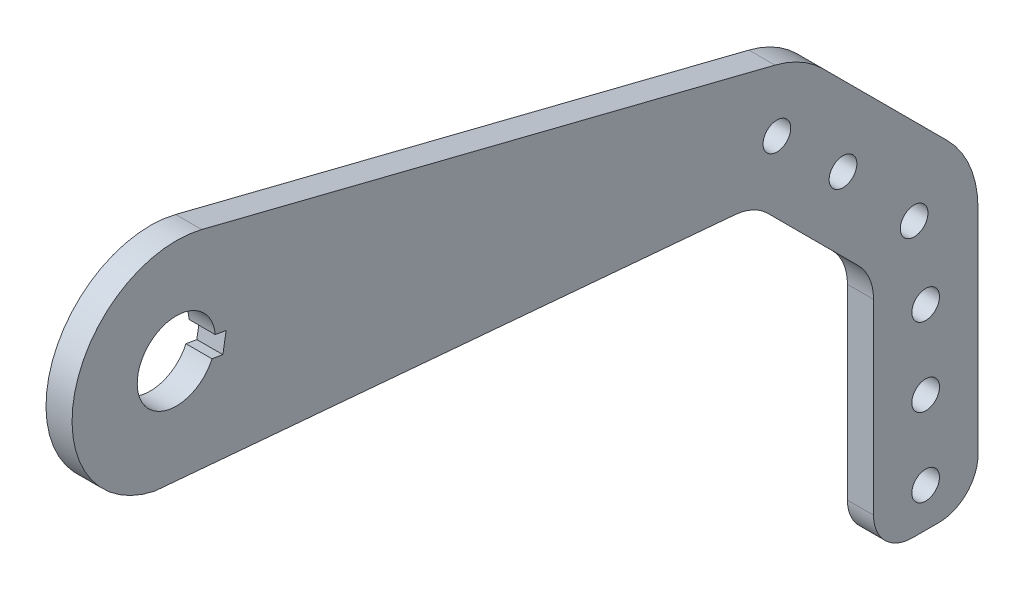
ISO-10303-21;
HEADER;
FILE_DESCRIPTION(('STEP AP214'),'2;1');
FILE_NAME('part.step','',(''),(''),'','','');
FILE_SCHEMA(('AUTOMOTIVE_DESIGN { 1 0 10303 214 1 1 1 1 }'));
ENDSEC;
DATA;
#1=APPLICATION_CONTEXT('core data for automotive mechanical design processes');
#2=APPLICATION_PROTOCOL_DEFINITION('international standard','automotive_design',2000,#1);
#3=PRODUCT_CONTEXT('',#1,'mechanical');
#4=PRODUCT('Part','Part','',(#3));
#5=PRODUCT_RELATED_PRODUCT_CATEGORY('part','',(#4));
#6=PRODUCT_DEFINITION_FORMATION('','',#4);
#7=PRODUCT_DEFINITION_CONTEXT('part definition',#1,'design');
#8=PRODUCT_DEFINITION('design','',#6,#7);
#9=PRODUCT_DEFINITION_SHAPE('','',#8);
#10=(LENGTH_UNIT() NAMED_UNIT(*) SI_UNIT(.MILLI.,.METRE.));
#11=(NAMED_UNIT(*) PLANE_ANGLE_UNIT() SI_UNIT($,.RADIAN.));
#12=(NAMED_UNIT(*) SI_UNIT($,.STERADIAN.) SOLID_ANGLE_UNIT());
#13=UNCERTAINTY_MEASURE_WITH_UNIT(LENGTH_MEASURE(1.E-05),#10,'distance_accuracy_value','');
#14=(GEOMETRIC_REPRESENTATION_CONTEXT(3) GLOBAL_UNCERTAINTY_ASSIGNED_CONTEXT((#13)) GLOBAL_UNIT_ASSIGNED_CONTEXT((#10,
#11,#12)) REPRESENTATION_CONTEXT('',''));
#15=CARTESIAN_POINT('',(0.,0.,0.));
#16=DIRECTION('',(0.,0.,1.));
#17=DIRECTION('',(1.,0.,0.));
#18=AXIS2_PLACEMENT_3D('',#15,#16,#17);
#19=CARTESIAN_POINT('',(12.7,0.,0.));
#20=DIRECTION('',(-1.,0.,0.));
#21=DIRECTION('',(0.,0.,1.));
#22=AXIS2_PLACEMENT_3D('',#19,#20,#21);
#23=CYLINDRICAL_SURFACE('',#22,50.8);
#24=CARTESIAN_POINT('',(0.,0.,0.));
#25=DIRECTION('',(1.,0.,0.));
#26=DIRECTION('',(0.,0.,-1.));
#27=AXIS2_PLACEMENT_3D('',#24,#25,#26);
#28=CIRCLE('',#27,50.8);
#29=CARTESIAN_POINT('',(0.,49.2644127270495,-12.3958718394036));
#30=VERTEX_POINT('',#29);
#31=CARTESIAN_POINT('',(0.,-49.6627771065191,10.6887122736185));
#32=VERTEX_POINT('',#31);
#33=EDGE_CURVE('E186',#30,#32,#28,.T.);
#34=ORIENTED_EDGE('',*,*,#33,.T.);
#35=DIRECTION('',(-1.,0.,0.));
#36=VECTOR('',#35,1.);
#37=CARTESIAN_POINT('',(12.7,-49.6627771065191,10.6887122736185));
#38=LINE('',#37,#36);
#39=CARTESIAN_POINT('',(12.7,-49.6627771065191,10.6887122736185));
#40=VERTEX_POINT('',#39);
#41=EDGE_CURVE('E220',#40,#32,#38,.T.);
#42=ORIENTED_EDGE('',*,*,#41,.F.);
#43=CARTESIAN_POINT('',(12.7,0.,0.));
#44=DIRECTION('',(1.,0.,0.));
#45=DIRECTION('',(0.,0.,-1.));
#46=AXIS2_PLACEMENT_3D('',#43,#44,#45);
#47=CIRCLE('',#46,50.8);
#48=CARTESIAN_POINT('',(12.7,49.2644127270495,-12.3958718394036));
#49=VERTEX_POINT('',#48);
#50=EDGE_CURVE('E356',#49,#40,#47,.T.);
#51=ORIENTED_EDGE('',*,*,#50,.F.);
#52=DIRECTION('',(-1.,0.,0.));
#53=VECTOR('',#52,1.);
#54=CARTESIAN_POINT('',(12.7,49.2644127270495,-12.3958718394036));
#55=LINE('',#54,#53);
#56=EDGE_CURVE('E217',#49,#30,#55,.T.);
#57=ORIENTED_EDGE('',*,*,#56,.T.);
#58=EDGE_LOOP('',(#34,#42,#51,#57));
#59=FACE_BOUND('',#58,.T.);
#60=ADVANCED_FACE('F37',(#59),#23,.T.);
#61=CARTESIAN_POINT('',(12.7,-50.2135702225281,4.39311814963394));
#62=DIRECTION('',(0.,0.996194698091746,-0.0871557427476547));
#63=DIRECTION('',(0.,0.0871557427476547,0.996194698091746));
#64=AXIS2_PLACEMENT_3D('',#61,#62,#63);
#65=PLANE('',#64);
#66=DIRECTION('',(0.,-0.0871557427476547,-0.996194698091746));
#67=VECTOR('',#66,1.);
#68=CARTESIAN_POINT('',(0.,-50.2135702225281,4.39311814963394));
#69=LINE('',#68,#67);
#70=CARTESIAN_POINT('',(0.,-74.4299171547794,-272.400993867823));
#71=VERTEX_POINT('',#70);
#72=EDGE_CURVE('E190',#32,#71,#69,.T.);
#73=ORIENTED_EDGE('',*,*,#72,.T.);
#74=DIRECTION('',(-1.,0.,0.));
#75=VECTOR('',#74,1.);
#76=CARTESIAN_POINT('',(12.7,-74.4299171547794,-272.400993867823));
#77=LINE('',#76,#75);
#78=CARTESIAN_POINT('',(12.7,-74.4299171547794,-272.400993867823));
#79=VERTEX_POINT('',#78);
#80=EDGE_CURVE('E231',#71,#79,#77,.F.);
#81=ORIENTED_EDGE('',*,*,#80,.T.);
#82=DIRECTION('',(0.,-0.0871557427476547,-0.996194698091746));
#83=VECTOR('',#82,1.);
#84=CARTESIAN_POINT('',(12.7,-50.2135702225281,4.39311814963394));
#85=LINE('',#84,#83);
#86=EDGE_CURVE('E331',#40,#79,#85,.T.);
#87=ORIENTED_EDGE('',*,*,#86,.F.);
#88=ORIENTED_EDGE('',*,*,#41,.T.);
#89=EDGE_LOOP('',(#73,#81,#87,#88));
#90=FACE_BOUND('',#89,.T.);
#91=ADVANCED_FACE('F328',(#90),#65,.F.);
#92=CARTESIAN_POINT('',(12.7,103.1875,-103.187499999999));
#93=DIRECTION('',(0.,0.707106781186549,-0.707106781186546));
#94=DIRECTION('',(0.,0.707106781186546,0.707106781186549));
#95=AXIS2_PLACEMENT_3D('',#92,#93,#94);
#96=PLANE('',#95);
#97=DIRECTION('',(0.,-0.707106781186546,-0.707106781186549));
#98=VECTOR('',#97,1.);
#99=CARTESIAN_POINT('',(0.,103.1875,-103.187499999999));
#100=LINE('',#99,#98);
#101=CARTESIAN_POINT('',(0.,-81.7727502441714,-288.147750244171));
#102=VERTEX_POINT('',#101);
#103=CARTESIAN_POINT('',(0.,-125.910512242138,-332.285512242138));
#104=VERTEX_POINT('',#103);
#105=EDGE_CURVE('E201',#102,#104,#100,.T.);
#106=ORIENTED_EDGE('',*,*,#105,.T.);
#107=DIRECTION('',(-1.,0.,0.));
#108=VECTOR('',#107,1.);
#109=CARTESIAN_POINT('',(12.7,-125.910512242138,-332.285512242138));
#110=LINE('',#109,#108);
#111=CARTESIAN_POINT('',(12.7,-125.910512242138,-332.285512242138));
#112=VERTEX_POINT('',#111);
#113=EDGE_CURVE('E229',#104,#112,#110,.F.);
#114=ORIENTED_EDGE('',*,*,#113,.T.);
#115=DIRECTION('',(0.,-0.707106781186546,-0.707106781186549));
#116=VECTOR('',#115,1.);
#117=CARTESIAN_POINT('',(12.7,103.1875,-103.187499999999));
#118=LINE('',#117,#116);
#119=CARTESIAN_POINT('',(12.7,-81.7727502441714,-288.147750244171));
#120=VERTEX_POINT('',#119);
#121=EDGE_CURVE('E321',#120,#112,#118,.T.);
#122=ORIENTED_EDGE('',*,*,#121,.F.);
#123=DIRECTION('',(-1.,0.,0.));
#124=VECTOR('',#123,1.);
#125=CARTESIAN_POINT('',(0.,-81.7727502441714,-288.147750244171));
#126=LINE('',#125,#124);
#127=EDGE_CURVE('E226',#120,#102,#126,.T.);
#128=ORIENTED_EDGE('',*,*,#127,.T.);
#129=EDGE_LOOP('',(#106,#114,#122,#128));
#130=FACE_BOUND('',#129,.T.);
#131=ADVANCED_FACE('F317',(#130),#96,.F.);
#132=CARTESIAN_POINT('',(12.7,-1.56307715309068E-13,-339.725));
#133=DIRECTION('',(0.,0.,-1.));
#134=DIRECTION('',(0.,1.,0.));
#135=AXIS2_PLACEMENT_3D('',#132,#133,#134);
#136=PLANE('',#135);
#137=DIRECTION('',(0.,-1.,0.));
#138=VECTOR('',#137,1.);
#139=CARTESIAN_POINT('',(0.,-1.56307715309068E-13,-339.725));
#140=LINE('',#139,#138);
#141=CARTESIAN_POINT('',(0.,-143.871024484277,-339.725));
#142=VERTEX_POINT('',#141);
#143=CARTESIAN_POINT('',(0.,-234.95,-339.725));
#144=VERTEX_POINT('',#143);
#145=EDGE_CURVE('E204',#142,#144,#140,.T.);
#146=ORIENTED_EDGE('',*,*,#145,.T.);
#147=DIRECTION('',(-1.,0.,0.));
#148=VECTOR('',#147,1.);
#149=CARTESIAN_POINT('',(12.7,-234.95,-339.725));
#150=LINE('',#149,#148);
#151=CARTESIAN_POINT('',(12.7,-234.95,-339.725));
#152=VERTEX_POINT('',#151);
#153=EDGE_CURVE('E45',#144,#152,#150,.F.);
#154=ORIENTED_EDGE('',*,*,#153,.T.);
#155=DIRECTION('',(0.,-1.,0.));
#156=VECTOR('',#155,1.);
#157=CARTESIAN_POINT('',(12.7,-1.56307715309068E-13,-339.725));
#158=LINE('',#157,#156);
#159=CARTESIAN_POINT('',(12.7,-143.871024484277,-339.725));
#160=VERTEX_POINT('',#159);
#161=EDGE_CURVE('E310',#160,#152,#158,.T.);
#162=ORIENTED_EDGE('',*,*,#161,.F.);
#163=DIRECTION('',(-1.,0.,0.));
#164=VECTOR('',#163,1.);
#165=CARTESIAN_POINT('',(0.,-143.871024484277,-339.725));
#166=LINE('',#165,#164);
#167=EDGE_CURVE('E223',#160,#142,#166,.T.);
#168=ORIENTED_EDGE('',*,*,#167,.T.);
#169=EDGE_LOOP('',(#146,#154,#162,#168));
#170=FACE_BOUND('',#169,.T.);
#171=ADVANCED_FACE('F308',(#170),#136,.F.);
#172=CARTESIAN_POINT('',(12.7,-254.,0.));
#173=DIRECTION('',(0.,1.,0.));
#174=DIRECTION('',(0.,0.,1.));
#175=AXIS2_PLACEMENT_3D('',#172,#173,#174);
#176=PLANE('',#175);
#177=DIRECTION('',(0.,0.,-1.));
#178=VECTOR('',#177,1.);
#179=CARTESIAN_POINT('',(0.,-254.,0.));
#180=LINE('',#179,#178);
#181=CARTESIAN_POINT('',(0.,-254.,-358.775));
#182=VERTEX_POINT('',#181);
#183=CARTESIAN_POINT('',(0.,-254.,-371.580407277116));
#184=VERTEX_POINT('',#183);
#185=EDGE_CURVE('E206',#182,#184,#180,.T.);
#186=ORIENTED_EDGE('',*,*,#185,.T.);
#187=DIRECTION('',(-1.,0.,0.));
#188=VECTOR('',#187,1.);
#189=CARTESIAN_POINT('',(12.7,-254.,-371.580407277116));
#190=LINE('',#189,#188);
#191=CARTESIAN_POINT('',(12.7,-254.,-371.580407277116));
#192=VERTEX_POINT('',#191);
#193=EDGE_CURVE('E276',#184,#192,#190,.F.);
#194=ORIENTED_EDGE('',*,*,#193,.T.);
#195=DIRECTION('',(0.,0.,-1.));
#196=VECTOR('',#195,1.);
#197=CARTESIAN_POINT('',(12.7,-254.,0.));
#198=LINE('',#197,#196);
#199=CARTESIAN_POINT('',(12.7,-254.,-358.775));
#200=VERTEX_POINT('',#199);
#201=EDGE_CURVE('E288',#200,#192,#198,.T.);
#202=ORIENTED_EDGE('',*,*,#201,.F.);
#203=DIRECTION('',(-1.,0.,0.));
#204=VECTOR('',#203,1.);
#205=CARTESIAN_POINT('',(12.7,-254.,-358.775));
#206=LINE('',#205,#204);
#207=EDGE_CURVE('E273',#200,#182,#206,.T.);
#208=ORIENTED_EDGE('',*,*,#207,.T.);
#209=EDGE_LOOP('',(#186,#194,#202,#208));
#210=FACE_BOUND('',#209,.T.);
#211=ADVANCED_FACE('F303',(#210),#176,.F.);
#212=CARTESIAN_POINT('',(12.7,0.,-390.630407277116));
#213=DIRECTION('',(0.,0.,1.));
#214=DIRECTION('',(1.,0.,0.));
#215=AXIS2_PLACEMENT_3D('',#212,#213,#214);
#216=PLANE('',#215);
#217=DIRECTION('',(0.,1.,0.));
#218=VECTOR('',#217,1.);
#219=CARTESIAN_POINT('',(12.7,0.,-390.630407277116));
#220=LINE('',#219,#218);
#221=CARTESIAN_POINT('',(12.7,-234.95,-390.630407277116));
#222=VERTEX_POINT('',#221);
#223=CARTESIAN_POINT('',(12.7,-130.809027211395,-390.630407277116));
#224=VERTEX_POINT('',#223);
#225=EDGE_CURVE('E286',#222,#224,#220,.T.);
#226=ORIENTED_EDGE('',*,*,#225,.F.);
#227=DIRECTION('',(-1.,0.,0.));
#228=VECTOR('',#227,1.);
#229=CARTESIAN_POINT('',(12.7,-234.95,-390.630407277116));
#230=LINE('',#229,#228);
#231=CARTESIAN_POINT('',(0.,-234.95,-390.630407277116));
#232=VERTEX_POINT('',#231);
#233=EDGE_CURVE('E260',#222,#232,#230,.T.);
#234=ORIENTED_EDGE('',*,*,#233,.T.);
#235=DIRECTION('',(0.,1.,0.));
#236=VECTOR('',#235,1.);
#237=CARTESIAN_POINT('',(0.,0.,-390.630407277116));
#238=LINE('',#237,#236);
#239=CARTESIAN_POINT('',(0.,-130.809027211395,-390.630407277116));
#240=VERTEX_POINT('',#239);
#241=EDGE_CURVE('E209',#232,#240,#238,.T.);
#242=ORIENTED_EDGE('',*,*,#241,.T.);
#243=DIRECTION('',(-1.,0.,0.));
#244=VECTOR('',#243,1.);
#245=CARTESIAN_POINT('',(12.7,-130.809027211395,-390.630407277116));
#246=LINE('',#245,#244);
#247=EDGE_CURVE('E251',#240,#224,#246,.F.);
#248=ORIENTED_EDGE('',*,*,#247,.T.);
#249=EDGE_LOOP('',(#226,#234,#242,#248));
#250=FACE_BOUND('',#249,.T.);
#251=ADVANCED_FACE('F293',(#250),#216,.F.);
#252=CARTESIAN_POINT('',(12.7,140.431714517137,-140.431714517136));
#253=DIRECTION('',(0.,-0.707106781186549,0.707106781186546));
#254=DIRECTION('',(0.,-0.707106781186546,-0.707106781186549));
#255=AXIS2_PLACEMENT_3D('',#252,#253,#254);
#256=PLANE('',#255);
#257=DIRECTION('',(0.,0.707106781186546,0.707106781186549));
#258=VECTOR('',#257,1.);
#259=CARTESIAN_POINT('',(12.7,140.431714517137,-140.431714517136));
#260=LINE('',#259,#258);
#261=CARTESIAN_POINT('',(12.7,-94.8880027271187,-375.751431761392));
#262=VERTEX_POINT('',#261);
#263=CARTESIAN_POINT('',(12.7,-34.3557528605558,-315.219181894829));
#264=VERTEX_POINT('',#263);
#265=EDGE_CURVE('E297',#262,#264,#260,.T.);
#266=ORIENTED_EDGE('',*,*,#265,.F.);
#267=DIRECTION('',(-1.,0.,0.));
#268=VECTOR('',#267,1.);
#269=CARTESIAN_POINT('',(12.7,-94.8880027271187,-375.751431761392));
#270=LINE('',#269,#268);
#271=CARTESIAN_POINT('',(0.,-94.8880027271187,-375.751431761392));
#272=VERTEX_POINT('',#271);
#273=EDGE_CURVE('E243',#262,#272,#270,.T.);
#274=ORIENTED_EDGE('',*,*,#273,.T.);
#275=DIRECTION('',(0.,0.707106781186546,0.707106781186549));
#276=VECTOR('',#275,1.);
#277=CARTESIAN_POINT('',(0.,140.431714517137,-140.431714517136));
#278=LINE('',#277,#276);
#279=CARTESIAN_POINT('',(0.,-34.3557528605558,-315.219181894829));
#280=VERTEX_POINT('',#279);
#281=EDGE_CURVE('E211',#272,#280,#278,.T.);
#282=ORIENTED_EDGE('',*,*,#281,.T.);
#283=DIRECTION('',(-1.,0.,0.));
#284=VECTOR('',#283,1.);
#285=CARTESIAN_POINT('',(12.7,-34.3557528605558,-315.219181894829));
#286=LINE('',#285,#284);
#287=EDGE_CURVE('E241',#280,#264,#286,.F.);
#288=ORIENTED_EDGE('',*,*,#287,.T.);
#289=EDGE_LOOP('',(#266,#274,#282,#288));
#290=FACE_BOUND('',#289,.T.);
#291=ADVANCED_FACE('F349',(#290),#256,.F.);
#292=CARTESIAN_POINT('',(12.7,0.,0.));
#293=DIRECTION('',(-1.,0.,0.));
#294=DIRECTION('',(0.,0.,1.));
#295=AXIS2_PLACEMENT_3D('',#292,#293,#294);
#296=CYLINDRICAL_SURFACE('',#295,19.05);
#297=DIRECTION('',(-1.,0.,0.));
#298=VECTOR('',#297,1.);
#299=CARTESIAN_POINT('',(12.7,-7.77285120237675,-17.3921040758647));
#300=LINE('',#299,#298);
#301=CARTESIAN_POINT('',(0.,-7.77285120237675,-17.3921040758647));
#302=VERTEX_POINT('',#301);
#303=CARTESIAN_POINT('',(12.7,-7.77285120237675,-17.3921040758647));
#304=VERTEX_POINT('',#303);
#305=EDGE_CURVE('E381',#302,#304,#300,.F.);
#306=ORIENTED_EDGE('',*,*,#305,.F.);
#307=CARTESIAN_POINT('',(0.,0.,0.));
#308=DIRECTION('',(1.,0.,0.));
#309=DIRECTION('',(0.,0.,-1.));
#310=AXIS2_PLACEMENT_3D('',#307,#308,#309);
#311=CIRCLE('',#310,19.05);
#312=CARTESIAN_POINT('',(0.,1.61867137808662,-18.9811064738008));
#313=VERTEX_POINT('',#312);
#314=EDGE_CURVE('E183',#313,#302,#311,.T.);
#315=ORIENTED_EDGE('',*,*,#314,.F.);
#316=DIRECTION('',(-1.,0.,0.));
#317=VECTOR('',#316,1.);
#318=CARTESIAN_POINT('',(12.7,1.61867137808662,-18.9811064738008));
#319=LINE('',#318,#317);
#320=CARTESIAN_POINT('',(12.7,1.61867137808662,-18.9811064738008));
#321=VERTEX_POINT('',#320);
#322=EDGE_CURVE('E171',#321,#313,#319,.T.);
#323=ORIENTED_EDGE('',*,*,#322,.F.);
#324=CARTESIAN_POINT('',(12.7,0.,0.));
#325=DIRECTION('',(1.,0.,0.));
#326=DIRECTION('',(0.,0.,-1.));
#327=AXIS2_PLACEMENT_3D('',#324,#325,#326);
#328=CIRCLE('',#327,19.05);
#329=EDGE_CURVE('E216',#321,#304,#328,.T.);
#330=ORIENTED_EDGE('',*,*,#329,.T.);
#331=EDGE_LOOP('',(#306,#315,#323,#330));
#332=FACE_BOUND('',#331,.T.);
#333=ADVANCED_FACE('F439',(#332),#296,.F.);
#334=CARTESIAN_POINT('',(12.7,49.2644127270496,-12.3958718394036));
#335=DIRECTION('',(0.,-0.969771904075778,0.244013225185111));
#336=DIRECTION('',(0.,-0.244013225185111,-0.969771904075778));
#337=AXIS2_PLACEMENT_3D('',#334,#335,#336);
#338=PLANE('',#337);
#339=DIRECTION('',(0.,0.244013225185111,0.969771904075778));
#340=VECTOR('',#339,1.);
#341=CARTESIAN_POINT('',(12.7,49.2644127270496,-12.3958718394036));
#342=LINE('',#341,#340);
#343=CARTESIAN_POINT('',(12.7,-21.0123646177829,-291.694029249956));
#344=VERTEX_POINT('',#343);
#345=EDGE_CURVE('E196',#344,#49,#342,.T.);
#346=ORIENTED_EDGE('',*,*,#345,.F.);
#347=DIRECTION('',(-1.,0.,0.));
#348=VECTOR('',#347,1.);
#349=CARTESIAN_POINT('',(12.7,-21.0123646177829,-291.694029249956));
#350=LINE('',#349,#348);
#351=CARTESIAN_POINT('',(0.,-21.0123646177829,-291.694029249956));
#352=VERTEX_POINT('',#351);
#353=EDGE_CURVE('E258',#344,#352,#350,.T.);
#354=ORIENTED_EDGE('',*,*,#353,.T.);
#355=DIRECTION('',(0.,0.244013225185111,0.969771904075778));
#356=VECTOR('',#355,1.);
#357=CARTESIAN_POINT('',(0.,49.2644127270496,-12.3958718394036));
#358=LINE('',#357,#356);
#359=EDGE_CURVE('E214',#352,#30,#358,.T.);
#360=ORIENTED_EDGE('',*,*,#359,.T.);
#361=ORIENTED_EDGE('',*,*,#56,.F.);
#362=EDGE_LOOP('',(#346,#354,#360,#361));
#363=FACE_BOUND('',#362,.T.);
#364=ADVANCED_FACE('F340',(#363),#338,.F.);
#365=CARTESIAN_POINT('',(12.7,0.,0.));
#366=DIRECTION('',(1.,0.,0.));
#367=DIRECTION('',(0.,0.,-1.));
#368=AXIS2_PLACEMENT_3D('',#365,#366,#367);
#369=PLANE('',#368);
#370=CARTESIAN_POINT('',(12.7,-51.4013719195865,-292.641331438062));
#371=DIRECTION('',(1.,0.,0.));
#372=DIRECTION('',(0.,0.,-1.));
#373=AXIS2_PLACEMENT_3D('',#370,#371,#372);
#374=CIRCLE('',#373,6.74624);
#375=CARTESIAN_POINT('',(12.7,-51.4013719195865,-299.387571438062));
#376=VERTEX_POINT('',#375);
#377=EDGE_CURVE('E394',#376,#376,#374,.T.);
#378=ORIENTED_EDGE('',*,*,#377,.F.);
#379=EDGE_LOOP('',(#378));
#380=FACE_BOUND('',#379,.T.);
#381=DIRECTION('',(0.,-0.166824398733448,-0.985986622620826));
#382=VECTOR('',#381,1.);
#383=CARTESIAN_POINT('',(12.7,-7.07926488713582,-13.292782671727));
#384=LINE('',#383,#382);
#385=CARTESIAN_POINT('',(12.7,-8.66826728507191,-22.6843052521904));
#386=VERTEX_POINT('',#385);
#387=EDGE_CURVE('E167',#304,#386,#384,.T.);
#388=ORIENTED_EDGE('',*,*,#387,.F.);
#389=ORIENTED_EDGE('',*,*,#329,.F.);
#390=DIRECTION('',(0.,0.166824398733448,0.985986622620826));
#391=VECTOR('',#390,1.);
#392=CARTESIAN_POINT('',(12.7,0.723255295391457,-24.2733076501265));
#393=LINE('',#392,#391);
#394=CARTESIAN_POINT('',(12.7,0.723255295391457,-24.2733076501265));
#395=VERTEX_POINT('',#394);
#396=EDGE_CURVE('E386',#395,#321,#393,.T.);
#397=ORIENTED_EDGE('',*,*,#396,.F.);
#398=DIRECTION('',(0.,0.985986622620826,-0.166824398733447));
#399=VECTOR('',#398,1.);
#400=CARTESIAN_POINT('',(12.7,-3.97250599484023,-23.4788064511584));
#401=LINE('',#400,#399);
#402=EDGE_CURVE('E388',#386,#395,#401,.T.);
#403=ORIENTED_EDGE('',*,*,#402,.F.);
#404=EDGE_LOOP('',(#388,#389,#397,#403));
#405=FACE_BOUND('',#404,.T.);
#406=CARTESIAN_POINT('',(12.7,-234.95,-365.125));
#407=DIRECTION('',(1.,0.,0.));
#408=DIRECTION('',(0.,0.,-1.));
#409=AXIS2_PLACEMENT_3D('',#406,#407,#408);
#410=CIRCLE('',#409,6.74623999999999);
#411=CARTESIAN_POINT('',(12.7,-234.95,-371.87124));
#412=VERTEX_POINT('',#411);
#413=EDGE_CURVE('E378',#412,#412,#410,.T.);
#414=ORIENTED_EDGE('',*,*,#413,.F.);
#415=EDGE_LOOP('',(#414));
#416=FACE_BOUND('',#415,.T.);
#417=CARTESIAN_POINT('',(12.7,-196.85,-365.125));
#418=DIRECTION('',(1.,0.,0.));
#419=DIRECTION('',(0.,0.,-1.));
#420=AXIS2_PLACEMENT_3D('',#417,#418,#419);
#421=CIRCLE('',#420,6.74623999999999);
#422=CARTESIAN_POINT('',(12.7,-196.85,-371.87124));
#423=VERTEX_POINT('',#422);
#424=EDGE_CURVE('E266',#423,#423,#421,.T.);
#425=ORIENTED_EDGE('',*,*,#424,.F.);
#426=EDGE_LOOP('',(#425));
#427=FACE_BOUND('',#426,.T.);
#428=CARTESIAN_POINT('',(12.7,-158.75,-365.125));
#429=DIRECTION('',(1.,0.,0.));
#430=DIRECTION('',(0.,0.,-1.));
#431=AXIS2_PLACEMENT_3D('',#428,#429,#430);
#432=CIRCLE('',#431,6.74623999999999);
#433=CARTESIAN_POINT('',(12.7,-158.75,-371.87124));
#434=VERTEX_POINT('',#433);
#435=EDGE_CURVE('E265',#434,#434,#432,.T.);
#436=ORIENTED_EDGE('',*,*,#435,.F.);
#437=EDGE_LOOP('',(#436));
#438=FACE_BOUND('',#437,.T.);
#439=CARTESIAN_POINT('',(12.7,-120.65,-359.507120599864));
#440=DIRECTION('',(1.,0.,0.));
#441=DIRECTION('',(0.,0.,-1.));
#442=AXIS2_PLACEMENT_3D('',#439,#440,#441);
#443=CIRCLE('',#442,6.74624);
#444=CARTESIAN_POINT('',(12.7,-120.65,-366.253360599864));
#445=VERTEX_POINT('',#444);
#446=EDGE_CURVE('E365',#445,#445,#443,.T.);
#447=ORIENTED_EDGE('',*,*,#446,.F.);
#448=EDGE_LOOP('',(#447));
#449=FACE_BOUND('',#448,.T.);
#450=CARTESIAN_POINT('',(12.7,-82.55,-324.846024484277));
#451=DIRECTION('',(1.,0.,0.));
#452=DIRECTION('',(0.,0.,-1.));
#453=AXIS2_PLACEMENT_3D('',#450,#451,#452);
#454=CIRCLE('',#453,6.74624);
#455=CARTESIAN_POINT('',(12.7,-82.55,-331.592264484277));
#456=VERTEX_POINT('',#455);
#457=EDGE_CURVE('E193',#456,#456,#454,.T.);
#458=ORIENTED_EDGE('',*,*,#457,.F.);
#459=EDGE_LOOP('',(#458));
#460=FACE_BOUND('',#459,.T.);
#461=ORIENTED_EDGE('',*,*,#201,.T.);
#462=CARTESIAN_POINT('',(12.7,-234.95,-371.580407277116));
#463=DIRECTION('',(1.,0.,0.));
#464=DIRECTION('',(0.,0.,-1.));
#465=AXIS2_PLACEMENT_3D('',#462,#463,#464);
#466=CIRCLE('',#465,19.05);
#467=EDGE_CURVE('E280',#192,#222,#466,.T.);
#468=ORIENTED_EDGE('',*,*,#467,.T.);
#469=ORIENTED_EDGE('',*,*,#225,.T.);
#470=CARTESIAN_POINT('',(12.7,-130.809027211395,-339.830407277116));
#471=DIRECTION('',(1.,0.,0.));
#472=DIRECTION('',(0.,0.,-1.));
#473=AXIS2_PLACEMENT_3D('',#470,#471,#472);
#474=CIRCLE('',#473,50.8);
#475=EDGE_CURVE('E256',#224,#262,#474,.T.);
#476=ORIENTED_EDGE('',*,*,#475,.T.);
#477=ORIENTED_EDGE('',*,*,#265,.T.);
#478=CARTESIAN_POINT('',(12.7,-70.2767773448325,-279.298157410553));
#479=DIRECTION('',(1.,0.,0.));
#480=DIRECTION('',(0.,0.,-1.));
#481=AXIS2_PLACEMENT_3D('',#478,#479,#480);
#482=CIRCLE('',#481,50.8);
#483=EDGE_CURVE('E254',#264,#344,#482,.T.);
#484=ORIENTED_EDGE('',*,*,#483,.T.);
#485=ORIENTED_EDGE('',*,*,#345,.T.);
#486=ORIENTED_EDGE('',*,*,#50,.T.);
#487=ORIENTED_EDGE('',*,*,#86,.T.);
#488=CARTESIAN_POINT('',(12.7,-99.7332624863097,-270.187238002033));
#489=DIRECTION('',(1.,0.,0.));
#490=DIRECTION('',(0.,0.,-1.));
#491=AXIS2_PLACEMENT_3D('',#488,#489,#490);
#492=CIRCLE('',#491,25.4);
#493=EDGE_CURVE('E239',#79,#120,#492,.F.);
#494=ORIENTED_EDGE('',*,*,#493,.T.);
#495=ORIENTED_EDGE('',*,*,#121,.T.);
#496=CARTESIAN_POINT('',(12.7,-143.871024484277,-314.325));
#497=DIRECTION('',(1.,0.,0.));
#498=DIRECTION('',(0.,0.,-1.));
#499=AXIS2_PLACEMENT_3D('',#496,#497,#498);
#500=CIRCLE('',#499,25.4);
#501=EDGE_CURVE('E235',#112,#160,#500,.F.);
#502=ORIENTED_EDGE('',*,*,#501,.T.);
#503=ORIENTED_EDGE('',*,*,#161,.T.);
#504=CARTESIAN_POINT('',(12.7,-234.95,-358.775));
#505=DIRECTION('',(1.,0.,0.));
#506=DIRECTION('',(0.,0.,-1.));
#507=AXIS2_PLACEMENT_3D('',#504,#505,#506);
#508=CIRCLE('',#507,19.05);
#509=EDGE_CURVE('E278',#152,#200,#508,.T.);
#510=ORIENTED_EDGE('',*,*,#509,.T.);
#511=EDGE_LOOP('',(#461,#468,#469,#476,#477,#484,#485,#486,#487,#494,#495,#502,#503,#510));
#512=FACE_BOUND('',#511,.T.);
#513=ADVANCED_FACE('F285',(#380,#405,#416,#427,#438,#449,#460,#512),#369,.T.);
#514=CARTESIAN_POINT('',(0.,0.,0.));
#515=DIRECTION('',(1.,0.,0.));
#516=DIRECTION('',(0.,0.,-1.));
#517=AXIS2_PLACEMENT_3D('',#514,#515,#516);
#518=PLANE('',#517);
#519=CARTESIAN_POINT('',(0.,-51.4013719195865,-292.641331438062));
#520=DIRECTION('',(1.,0.,0.));
#521=DIRECTION('',(0.,0.,-1.));
#522=AXIS2_PLACEMENT_3D('',#519,#520,#521);
#523=CIRCLE('',#522,6.74623999999999);
#524=CARTESIAN_POINT('',(0.,-51.4013719195865,-299.387571438062));
#525=VERTEX_POINT('',#524);
#526=EDGE_CURVE('E390',#525,#525,#523,.T.);
#527=ORIENTED_EDGE('',*,*,#526,.T.);
#528=EDGE_LOOP('',(#527));
#529=FACE_BOUND('',#528,.T.);
#530=ORIENTED_EDGE('',*,*,#314,.T.);
#531=DIRECTION('',(0.,-0.166824398733448,-0.985986622620826));
#532=VECTOR('',#531,1.);
#533=CARTESIAN_POINT('',(0.,-4.69576129023168,0.794501198968045));
#534=LINE('',#533,#532);
#535=CARTESIAN_POINT('',(0.,-8.66826728507191,-22.6843052521904));
#536=VERTEX_POINT('',#535);
#537=EDGE_CURVE('E11',#302,#536,#534,.T.);
#538=ORIENTED_EDGE('',*,*,#537,.T.);
#539=DIRECTION('',(0.,0.985986622620826,-0.166824398733448));
#540=VECTOR('',#539,1.);
#541=CARTESIAN_POINT('',(0.,-8.66826728507191,-22.6843052521904));
#542=LINE('',#541,#540);
#543=CARTESIAN_POINT('',(0.,0.723255295391457,-24.2733076501265));
#544=VERTEX_POINT('',#543);
#545=EDGE_CURVE('E175',#536,#544,#542,.T.);
#546=ORIENTED_EDGE('',*,*,#545,.T.);
#547=DIRECTION('',(0.,0.166824398733448,0.985986622620826));
#548=VECTOR('',#547,1.);
#549=CARTESIAN_POINT('',(0.,0.723255295391457,-24.2733076501265));
#550=LINE('',#549,#548);
#551=EDGE_CURVE('E52',#544,#313,#550,.T.);
#552=ORIENTED_EDGE('',*,*,#551,.T.);
#553=EDGE_LOOP('',(#530,#538,#546,#552));
#554=FACE_BOUND('',#553,.T.);
#555=CARTESIAN_POINT('',(0.,-234.95,-365.125));
#556=DIRECTION('',(1.,0.,0.));
#557=DIRECTION('',(0.,0.,-1.));
#558=AXIS2_PLACEMENT_3D('',#555,#556,#557);
#559=CIRCLE('',#558,6.74623999999999);
#560=CARTESIAN_POINT('',(0.,-234.95,-371.87124));
#561=VERTEX_POINT('',#560);
#562=EDGE_CURVE('E375',#561,#561,#559,.T.);
#563=ORIENTED_EDGE('',*,*,#562,.T.);
#564=EDGE_LOOP('',(#563));
#565=FACE_BOUND('',#564,.T.);
#566=CARTESIAN_POINT('',(0.,-196.85,-365.125));
#567=DIRECTION('',(1.,0.,0.));
#568=DIRECTION('',(0.,0.,-1.));
#569=AXIS2_PLACEMENT_3D('',#566,#567,#568);
#570=CIRCLE('',#569,6.74623999999999);
#571=CARTESIAN_POINT('',(0.,-196.85,-371.87124));
#572=VERTEX_POINT('',#571);
#573=EDGE_CURVE('E262',#572,#572,#570,.T.);
#574=ORIENTED_EDGE('',*,*,#573,.T.);
#575=EDGE_LOOP('',(#574));
#576=FACE_BOUND('',#575,.T.);
#577=CARTESIAN_POINT('',(0.,-158.75,-365.125));
#578=DIRECTION('',(1.,0.,0.));
#579=DIRECTION('',(0.,0.,-1.));
#580=AXIS2_PLACEMENT_3D('',#577,#578,#579);
#581=CIRCLE('',#580,6.74623999999999);
#582=CARTESIAN_POINT('',(0.,-158.75,-371.87124));
#583=VERTEX_POINT('',#582);
#584=EDGE_CURVE('E368',#583,#583,#581,.T.);
#585=ORIENTED_EDGE('',*,*,#584,.T.);
#586=EDGE_LOOP('',(#585));
#587=FACE_BOUND('',#586,.T.);
#588=CARTESIAN_POINT('',(0.,-120.65,-359.507120599864));
#589=DIRECTION('',(1.,0.,0.));
#590=DIRECTION('',(0.,0.,-1.));
#591=AXIS2_PLACEMENT_3D('',#588,#589,#590);
#592=CIRCLE('',#591,6.74623999999999);
#593=CARTESIAN_POINT('',(0.,-120.65,-366.253360599864));
#594=VERTEX_POINT('',#593);
#595=EDGE_CURVE('E362',#594,#594,#592,.T.);
#596=ORIENTED_EDGE('',*,*,#595,.T.);
#597=EDGE_LOOP('',(#596));
#598=FACE_BOUND('',#597,.T.);
#599=CARTESIAN_POINT('',(0.,-82.55,-324.846024484277));
#600=DIRECTION('',(1.,0.,0.));
#601=DIRECTION('',(0.,0.,-1.));
#602=AXIS2_PLACEMENT_3D('',#599,#600,#601);
#603=CIRCLE('',#602,6.74623999999999);
#604=CARTESIAN_POINT('',(0.,-82.55,-331.592264484277));
#605=VERTEX_POINT('',#604);
#606=EDGE_CURVE('E187',#605,#605,#603,.T.);
#607=ORIENTED_EDGE('',*,*,#606,.T.);
#608=EDGE_LOOP('',(#607));
#609=FACE_BOUND('',#608,.T.);
#610=ORIENTED_EDGE('',*,*,#241,.F.);
#611=CARTESIAN_POINT('',(0.,-234.95,-371.580407277116));
#612=DIRECTION('',(1.,0.,0.));
#613=DIRECTION('',(0.,0.,-1.));
#614=AXIS2_PLACEMENT_3D('',#611,#612,#613);
#615=CIRCLE('',#614,19.05);
#616=EDGE_CURVE('E271',#232,#184,#615,.F.);
#617=ORIENTED_EDGE('',*,*,#616,.T.);
#618=ORIENTED_EDGE('',*,*,#185,.F.);
#619=CARTESIAN_POINT('',(0.,-234.95,-358.775));
#620=DIRECTION('',(1.,0.,0.));
#621=DIRECTION('',(0.,0.,-1.));
#622=AXIS2_PLACEMENT_3D('',#619,#620,#621);
#623=CIRCLE('',#622,19.05);
#624=EDGE_CURVE('E269',#182,#144,#623,.F.);
#625=ORIENTED_EDGE('',*,*,#624,.T.);
#626=ORIENTED_EDGE('',*,*,#145,.F.);
#627=CARTESIAN_POINT('',(0.,-143.871024484277,-314.325));
#628=DIRECTION('',(1.,0.,0.));
#629=DIRECTION('',(0.,0.,-1.));
#630=AXIS2_PLACEMENT_3D('',#627,#628,#629);
#631=CIRCLE('',#630,25.4);
#632=EDGE_CURVE('E233',#142,#104,#631,.T.);
#633=ORIENTED_EDGE('',*,*,#632,.T.);
#634=ORIENTED_EDGE('',*,*,#105,.F.);
#635=CARTESIAN_POINT('',(0.,-99.7332624863097,-270.187238002033));
#636=DIRECTION('',(1.,0.,0.));
#637=DIRECTION('',(0.,0.,-1.));
#638=AXIS2_PLACEMENT_3D('',#635,#636,#637);
#639=CIRCLE('',#638,25.4);
#640=EDGE_CURVE('E237',#102,#71,#639,.T.);
#641=ORIENTED_EDGE('',*,*,#640,.T.);
#642=ORIENTED_EDGE('',*,*,#72,.F.);
#643=ORIENTED_EDGE('',*,*,#33,.F.);
#644=ORIENTED_EDGE('',*,*,#359,.F.);
#645=CARTESIAN_POINT('',(0.,-70.2767773448325,-279.298157410553));
#646=DIRECTION('',(1.,0.,0.));
#647=DIRECTION('',(0.,0.,-1.));
#648=AXIS2_PLACEMENT_3D('',#645,#646,#647);
#649=CIRCLE('',#648,50.8);
#650=EDGE_CURVE('E246',#352,#280,#649,.F.);
#651=ORIENTED_EDGE('',*,*,#650,.T.);
#652=ORIENTED_EDGE('',*,*,#281,.F.);
#653=CARTESIAN_POINT('',(0.,-130.809027211395,-339.830407277116));
#654=DIRECTION('',(1.,0.,0.));
#655=DIRECTION('',(0.,0.,-1.));
#656=AXIS2_PLACEMENT_3D('',#653,#654,#655);
#657=CIRCLE('',#656,50.8);
#658=EDGE_CURVE('E248',#272,#240,#657,.F.);
#659=ORIENTED_EDGE('',*,*,#658,.T.);
#660=EDGE_LOOP('',(#610,#617,#618,#625,#626,#633,#634,#641,#642,#643,#644,#651,#652,#659));
#661=FACE_BOUND('',#660,.T.);
#662=ADVANCED_FACE('F180',(#529,#554,#565,#576,#587,#598,#609,#661),#518,.F.);
#663=CARTESIAN_POINT('',(12.7,-143.871024484277,-314.325));
#664=DIRECTION('',(1.,0.,0.));
#665=DIRECTION('',(0.,0.,-1.));
#666=AXIS2_PLACEMENT_3D('',#663,#664,#665);
#667=CYLINDRICAL_SURFACE('',#666,25.4);
#668=ORIENTED_EDGE('',*,*,#501,.F.);
#669=ORIENTED_EDGE('',*,*,#113,.F.);
#670=ORIENTED_EDGE('',*,*,#632,.F.);
#671=ORIENTED_EDGE('',*,*,#167,.F.);
#672=EDGE_LOOP('',(#668,#669,#670,#671));
#673=FACE_BOUND('',#672,.T.);
#674=ADVANCED_FACE('F313',(#673),#667,.F.);
#675=CARTESIAN_POINT('',(12.7,-99.7332624863097,-270.187238002033));
#676=DIRECTION('',(1.,0.,0.));
#677=DIRECTION('',(0.,0.,-1.));
#678=AXIS2_PLACEMENT_3D('',#675,#676,#677);
#679=CYLINDRICAL_SURFACE('',#678,25.4);
#680=ORIENTED_EDGE('',*,*,#493,.F.);
#681=ORIENTED_EDGE('',*,*,#80,.F.);
#682=ORIENTED_EDGE('',*,*,#640,.F.);
#683=ORIENTED_EDGE('',*,*,#127,.F.);
#684=EDGE_LOOP('',(#680,#681,#682,#683));
#685=FACE_BOUND('',#684,.T.);
#686=ADVANCED_FACE('F324',(#685),#679,.F.);
#687=CARTESIAN_POINT('',(12.7,-130.809027211395,-339.830407277116));
#688=DIRECTION('',(-1.,0.,0.));
#689=DIRECTION('',(0.,0.,1.));
#690=AXIS2_PLACEMENT_3D('',#687,#688,#689);
#691=CYLINDRICAL_SURFACE('',#690,50.8);
#692=ORIENTED_EDGE('',*,*,#475,.F.);
#693=ORIENTED_EDGE('',*,*,#247,.F.);
#694=ORIENTED_EDGE('',*,*,#658,.F.);
#695=ORIENTED_EDGE('',*,*,#273,.F.);
#696=EDGE_LOOP('',(#692,#693,#694,#695));
#697=FACE_BOUND('',#696,.T.);
#698=ADVANCED_FACE('F444',(#697),#691,.T.);
#699=CARTESIAN_POINT('',(12.7,-70.2767773448325,-279.298157410553));
#700=DIRECTION('',(-1.,0.,0.));
#701=DIRECTION('',(0.,0.,1.));
#702=AXIS2_PLACEMENT_3D('',#699,#700,#701);
#703=CYLINDRICAL_SURFACE('',#702,50.8);
#704=ORIENTED_EDGE('',*,*,#483,.F.);
#705=ORIENTED_EDGE('',*,*,#287,.F.);
#706=ORIENTED_EDGE('',*,*,#650,.F.);
#707=ORIENTED_EDGE('',*,*,#353,.F.);
#708=EDGE_LOOP('',(#704,#705,#706,#707));
#709=FACE_BOUND('',#708,.T.);
#710=ADVANCED_FACE('F344',(#709),#703,.T.);
#711=CARTESIAN_POINT('',(12.7,-82.55,-324.846024484277));
#712=DIRECTION('',(1.,0.,0.));
#713=DIRECTION('',(0.,0.,-1.));
#714=AXIS2_PLACEMENT_3D('',#711,#712,#713);
#715=CYLINDRICAL_SURFACE('',#714,6.74623999999999);
#716=ORIENTED_EDGE('',*,*,#457,.T.);
#717=EDGE_LOOP('',(#716));
#718=FACE_BOUND('',#717,.T.);
#719=ORIENTED_EDGE('',*,*,#606,.F.);
#720=EDGE_LOOP('',(#719));
#721=FACE_BOUND('',#720,.T.);
#722=ADVANCED_FACE('F415',(#718,#721),#715,.F.);
#723=CARTESIAN_POINT('',(12.7,-120.65,-359.507120599864));
#724=DIRECTION('',(1.,0.,0.));
#725=DIRECTION('',(0.,0.,-1.));
#726=AXIS2_PLACEMENT_3D('',#723,#724,#725);
#727=CYLINDRICAL_SURFACE('',#726,6.74623999999999);
#728=ORIENTED_EDGE('',*,*,#446,.T.);
#729=EDGE_LOOP('',(#728));
#730=FACE_BOUND('',#729,.T.);
#731=ORIENTED_EDGE('',*,*,#595,.F.);
#732=EDGE_LOOP('',(#731));
#733=FACE_BOUND('',#732,.T.);
#734=ADVANCED_FACE('F418',(#730,#733),#727,.F.);
#735=CARTESIAN_POINT('',(12.7,-158.75,-365.125));
#736=DIRECTION('',(1.,0.,0.));
#737=DIRECTION('',(0.,0.,-1.));
#738=AXIS2_PLACEMENT_3D('',#735,#736,#737);
#739=CYLINDRICAL_SURFACE('',#738,6.74623999999999);
#740=ORIENTED_EDGE('',*,*,#435,.T.);
#741=EDGE_LOOP('',(#740));
#742=FACE_BOUND('',#741,.T.);
#743=ORIENTED_EDGE('',*,*,#584,.F.);
#744=EDGE_LOOP('',(#743));
#745=FACE_BOUND('',#744,.T.);
#746=ADVANCED_FACE('F461',(#742,#745),#739,.F.);
#747=CARTESIAN_POINT('',(12.7,-196.85,-365.125));
#748=DIRECTION('',(1.,0.,0.));
#749=DIRECTION('',(0.,0.,-1.));
#750=AXIS2_PLACEMENT_3D('',#747,#748,#749);
#751=CYLINDRICAL_SURFACE('',#750,6.74623999999999);
#752=ORIENTED_EDGE('',*,*,#424,.T.);
#753=EDGE_LOOP('',(#752));
#754=FACE_BOUND('',#753,.T.);
#755=ORIENTED_EDGE('',*,*,#573,.F.);
#756=EDGE_LOOP('',(#755));
#757=FACE_BOUND('',#756,.T.);
#758=ADVANCED_FACE('F455',(#754,#757),#751,.F.);
#759=CARTESIAN_POINT('',(12.7,-234.95,-365.125));
#760=DIRECTION('',(1.,0.,0.));
#761=DIRECTION('',(0.,0.,-1.));
#762=AXIS2_PLACEMENT_3D('',#759,#760,#761);
#763=CYLINDRICAL_SURFACE('',#762,6.74623999999999);
#764=ORIENTED_EDGE('',*,*,#413,.T.);
#765=EDGE_LOOP('',(#764));
#766=FACE_BOUND('',#765,.T.);
#767=ORIENTED_EDGE('',*,*,#562,.F.);
#768=EDGE_LOOP('',(#767));
#769=FACE_BOUND('',#768,.T.);
#770=ADVANCED_FACE('F450',(#766,#769),#763,.F.);
#771=CARTESIAN_POINT('',(12.7,-234.95,-371.580407277116));
#772=DIRECTION('',(-1.,0.,0.));
#773=DIRECTION('',(0.,0.,1.));
#774=AXIS2_PLACEMENT_3D('',#771,#772,#773);
#775=CYLINDRICAL_SURFACE('',#774,19.05);
#776=ORIENTED_EDGE('',*,*,#467,.F.);
#777=ORIENTED_EDGE('',*,*,#193,.F.);
#778=ORIENTED_EDGE('',*,*,#616,.F.);
#779=ORIENTED_EDGE('',*,*,#233,.F.);
#780=EDGE_LOOP('',(#776,#777,#778,#779));
#781=FACE_BOUND('',#780,.T.);
#782=ADVANCED_FACE('F299',(#781),#775,.T.);
#783=CARTESIAN_POINT('',(12.7,-234.95,-358.775));
#784=DIRECTION('',(-1.,0.,0.));
#785=DIRECTION('',(0.,0.,1.));
#786=AXIS2_PLACEMENT_3D('',#783,#784,#785);
#787=CYLINDRICAL_SURFACE('',#786,19.05);
#788=ORIENTED_EDGE('',*,*,#509,.F.);
#789=ORIENTED_EDGE('',*,*,#153,.F.);
#790=ORIENTED_EDGE('',*,*,#624,.F.);
#791=ORIENTED_EDGE('',*,*,#207,.F.);
#792=EDGE_LOOP('',(#788,#789,#790,#791));
#793=FACE_BOUND('',#792,.T.);
#794=ADVANCED_FACE('F39',(#793),#787,.T.);
#795=CARTESIAN_POINT('',(0.,-7.07926488713582,-13.292782671727));
#796=DIRECTION('',(0.,-0.985986622620826,0.166824398733448));
#797=DIRECTION('',(0.,-0.166824398733448,-0.985986622620826));
#798=AXIS2_PLACEMENT_3D('',#795,#796,#797);
#799=PLANE('',#798);
#800=ORIENTED_EDGE('',*,*,#305,.T.);
#801=ORIENTED_EDGE('',*,*,#387,.T.);
#802=DIRECTION('',(1.,0.,0.));
#803=VECTOR('',#802,1.);
#804=CARTESIAN_POINT('',(0.,-8.66826728507191,-22.6843052521904));
#805=LINE('',#804,#803);
#806=EDGE_CURVE('E162',#536,#386,#805,.T.);
#807=ORIENTED_EDGE('',*,*,#806,.F.);
#808=ORIENTED_EDGE('',*,*,#537,.F.);
#809=EDGE_LOOP('',(#800,#801,#807,#808));
#810=FACE_BOUND('',#809,.T.);
#811=ADVANCED_FACE('F164',(#810),#799,.F.);
#812=CARTESIAN_POINT('',(0.,0.723255295391457,-24.2733076501265));
#813=DIRECTION('',(0.,0.985986622620826,-0.166824398733448));
#814=DIRECTION('',(0.,0.166824398733448,0.985986622620826));
#815=AXIS2_PLACEMENT_3D('',#812,#813,#814);
#816=PLANE('',#815);
#817=ORIENTED_EDGE('',*,*,#322,.T.);
#818=ORIENTED_EDGE('',*,*,#551,.F.);
#819=DIRECTION('',(1.,0.,0.));
#820=VECTOR('',#819,1.);
#821=CARTESIAN_POINT('',(0.,0.723255295391457,-24.2733076501265));
#822=LINE('',#821,#820);
#823=EDGE_CURVE('E172',#544,#395,#822,.T.);
#824=ORIENTED_EDGE('',*,*,#823,.T.);
#825=ORIENTED_EDGE('',*,*,#396,.T.);
#826=EDGE_LOOP('',(#817,#818,#824,#825));
#827=FACE_BOUND('',#826,.T.);
#828=ADVANCED_FACE('F544',(#827),#816,.F.);
#829=CARTESIAN_POINT('',(0.,-3.97250599484023,-23.4788064511584));
#830=DIRECTION('',(0.,-0.166824398733447,-0.985986622620826));
#831=DIRECTION('',(0.,0.985986622620826,-0.166824398733447));
#832=AXIS2_PLACEMENT_3D('',#829,#830,#831);
#833=PLANE('',#832);
#834=ORIENTED_EDGE('',*,*,#402,.T.);
#835=ORIENTED_EDGE('',*,*,#823,.F.);
#836=ORIENTED_EDGE('',*,*,#545,.F.);
#837=ORIENTED_EDGE('',*,*,#806,.T.);
#838=EDGE_LOOP('',(#834,#835,#836,#837));
#839=FACE_BOUND('',#838,.T.);
#840=ADVANCED_FACE('F176',(#839),#833,.F.);
#841=CARTESIAN_POINT('',(12.7,-51.4013719195865,-292.641331438062));
#842=DIRECTION('',(1.,0.,0.));
#843=DIRECTION('',(0.,0.,-1.));
#844=AXIS2_PLACEMENT_3D('',#841,#842,#843);
#845=CYLINDRICAL_SURFACE('',#844,6.74624);
#846=ORIENTED_EDGE('',*,*,#526,.F.);
#847=EDGE_LOOP('',(#846));
#848=FACE_BOUND('',#847,.T.);
#849=ORIENTED_EDGE('',*,*,#377,.T.);
#850=EDGE_LOOP('',(#849));
#851=FACE_BOUND('',#850,.T.);
#852=ADVANCED_FACE('F398',(#848,#851),#845,.F.);
#853=CLOSED_SHELL('',(#60,#91,#131,#171,#211,#251,#291,#333,#364,#513,#662,#674,#686,#698,#710,
#722,#734,#746,#758,#770,#782,#794,#811,#828,#840,#852));
#854=MANIFOLD_SOLID_BREP('B2',#853);
#855=ADVANCED_BREP_SHAPE_REPRESENTATION('',(#18,#854),#14);
#856=SHAPE_DEFINITION_REPRESENTATION(#9,#855);
ENDSEC;
END-ISO-10303-21;
